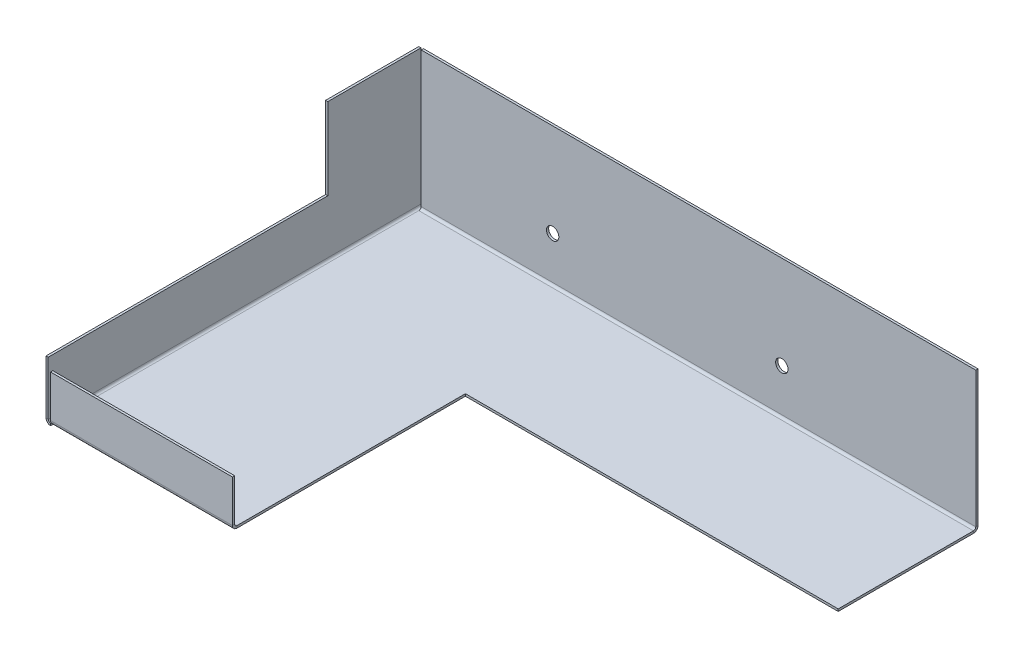
ISO-10303-21;
HEADER;
FILE_DESCRIPTION(('STEP AP214'),'2;1');
FILE_NAME('part.step','',(''),(''),'','','');
FILE_SCHEMA(('AUTOMOTIVE_DESIGN { 1 0 10303 214 1 1 1 1 }'));
ENDSEC;
DATA;
#1=APPLICATION_CONTEXT('core data for automotive mechanical design processes');
#2=APPLICATION_PROTOCOL_DEFINITION('international standard','automotive_design',2000,#1);
#3=PRODUCT_CONTEXT('',#1,'mechanical');
#4=PRODUCT('Part','Part','',(#3));
#5=PRODUCT_RELATED_PRODUCT_CATEGORY('part','',(#4));
#6=PRODUCT_DEFINITION_FORMATION('','',#4);
#7=PRODUCT_DEFINITION_CONTEXT('part definition',#1,'design');
#8=PRODUCT_DEFINITION('design','',#6,#7);
#9=PRODUCT_DEFINITION_SHAPE('','',#8);
#10=(LENGTH_UNIT() NAMED_UNIT(*) SI_UNIT(.MILLI.,.METRE.));
#11=(NAMED_UNIT(*) PLANE_ANGLE_UNIT() SI_UNIT($,.RADIAN.));
#12=(NAMED_UNIT(*) SI_UNIT($,.STERADIAN.) SOLID_ANGLE_UNIT());
#13=UNCERTAINTY_MEASURE_WITH_UNIT(LENGTH_MEASURE(1.E-05),#10,'distance_accuracy_value','');
#14=(GEOMETRIC_REPRESENTATION_CONTEXT(3) GLOBAL_UNCERTAINTY_ASSIGNED_CONTEXT((#13)) GLOBAL_UNIT_ASSIGNED_CONTEXT((#10,
#11,#12)) REPRESENTATION_CONTEXT('',''));
#15=CARTESIAN_POINT('',(0.,0.,0.));
#16=DIRECTION('',(0.,0.,1.));
#17=DIRECTION('',(1.,0.,0.));
#18=AXIS2_PLACEMENT_3D('',#15,#16,#17);
#19=CARTESIAN_POINT('',(2.4892,0.,-2.4892));
#20=DIRECTION('',(1.,0.,0.));
#21=DIRECTION('',(0.,0.,-1.));
#22=AXIS2_PLACEMENT_3D('',#19,#20,#21);
#23=PLANE('',#22);
#24=DIRECTION('',(0.,0.,1.));
#25=VECTOR('',#24,1.);
#26=CARTESIAN_POINT('',(2.4892,-1.2192,0.));
#27=LINE('',#26,#25);
#28=CARTESIAN_POINT('',(2.4892,-1.2192,0.));
#29=VERTEX_POINT('',#28);
#30=CARTESIAN_POINT('',(2.4892,-1.2192,-2.4892));
#31=VERTEX_POINT('',#30);
#32=EDGE_CURVE('E432',#29,#31,#27,.F.);
#33=ORIENTED_EDGE('',*,*,#32,.T.);
#34=CARTESIAN_POINT('',(2.4892,1.27,-2.4892));
#35=DIRECTION('',(1.,0.,0.));
#36=DIRECTION('',(0.,0.,-1.));
#37=AXIS2_PLACEMENT_3D('',#34,#35,#36);
#38=CIRCLE('',#37,2.4892);
#39=CARTESIAN_POINT('',(2.4892,0.,-0.348355157420321));
#40=VERTEX_POINT('',#39);
#41=EDGE_CURVE('E305',#31,#40,#38,.F.);
#42=ORIENTED_EDGE('',*,*,#41,.T.);
#43=DIRECTION('',(0.,0.,1.));
#44=VECTOR('',#43,1.);
#45=CARTESIAN_POINT('',(2.4892,0.,0.));
#46=LINE('',#45,#44);
#47=CARTESIAN_POINT('',(2.4892,0.,0.));
#48=VERTEX_POINT('',#47);
#49=EDGE_CURVE('E446',#48,#40,#46,.F.);
#50=ORIENTED_EDGE('',*,*,#49,.F.);
#51=DIRECTION('',(0.,-1.,0.));
#52=VECTOR('',#51,1.);
#53=CARTESIAN_POINT('',(2.4892,0.,0.));
#54=LINE('',#53,#52);
#55=EDGE_CURVE('E439',#48,#29,#54,.T.);
#56=ORIENTED_EDGE('',*,*,#55,.T.);
#57=EDGE_LOOP('',(#33,#42,#50,#56));
#58=FACE_BOUND('',#57,.T.);
#59=ADVANCED_FACE('F100',(#58),#23,.T.);
#60=CARTESIAN_POINT('',(0.,-1.2192,0.));
#61=DIRECTION('',(0.,1.,0.));
#62=DIRECTION('',(0.,0.,1.));
#63=AXIS2_PLACEMENT_3D('',#60,#61,#62);
#64=PLANE('',#63);
#65=DIRECTION('',(1.,0.,0.));
#66=VECTOR('',#65,1.);
#67=CARTESIAN_POINT('',(101.6,-1.2192,-2.4892));
#68=LINE('',#67,#66);
#69=CARTESIAN_POINT('',(101.6,-1.2192,-2.4892));
#70=VERTEX_POINT('',#69);
#71=EDGE_CURVE('E300',#70,#31,#68,.F.);
#72=ORIENTED_EDGE('',*,*,#71,.T.);
#73=CARTESIAN_POINT('',(2.48920000000002,-1.2192,-200.7108));
#74=VERTEX_POINT('',#73);
#75=EDGE_CURVE('E436',#31,#74,#27,.F.);
#76=ORIENTED_EDGE('',*,*,#75,.T.);
#77=DIRECTION('',(-1.,0.,0.));
#78=VECTOR('',#77,1.);
#79=CARTESIAN_POINT('',(2.48919999999997,-1.21920000000001,-200.7108));
#80=LINE('',#79,#78);
#81=CARTESIAN_POINT('',(304.8,-1.2192,-200.7108));
#82=VERTEX_POINT('',#81);
#83=EDGE_CURVE('E378',#74,#82,#80,.F.);
#84=ORIENTED_EDGE('',*,*,#83,.T.);
#85=DIRECTION('',(0.,0.,-1.));
#86=VECTOR('',#85,1.);
#87=CARTESIAN_POINT('',(304.8,-1.2192,-127.));
#88=LINE('',#87,#86);
#89=CARTESIAN_POINT('',(304.8,-1.2192,-127.));
#90=VERTEX_POINT('',#89);
#91=EDGE_CURVE('E464',#90,#82,#88,.T.);
#92=ORIENTED_EDGE('',*,*,#91,.F.);
#93=DIRECTION('',(1.,0.,0.));
#94=VECTOR('',#93,1.);
#95=CARTESIAN_POINT('',(101.6,-1.2192,-127.));
#96=LINE('',#95,#94);
#97=CARTESIAN_POINT('',(101.6,-1.2192,-127.));
#98=VERTEX_POINT('',#97);
#99=EDGE_CURVE('E460',#98,#90,#96,.T.);
#100=ORIENTED_EDGE('',*,*,#99,.F.);
#101=DIRECTION('',(0.,0.,-1.));
#102=VECTOR('',#101,1.);
#103=CARTESIAN_POINT('',(101.6,-1.2192,0.));
#104=LINE('',#103,#102);
#105=EDGE_CURVE('E458',#70,#98,#104,.T.);
#106=ORIENTED_EDGE('',*,*,#105,.F.);
#107=EDGE_LOOP('',(#72,#76,#84,#92,#100,#106));
#108=FACE_BOUND('',#107,.T.);
#109=ADVANCED_FACE('F504',(#108),#64,.F.);
#110=CARTESIAN_POINT('',(0.,0.,0.));
#111=DIRECTION('',(0.,1.,0.));
#112=DIRECTION('',(0.,0.,1.));
#113=AXIS2_PLACEMENT_3D('',#110,#111,#112);
#114=PLANE('',#113);
#115=CARTESIAN_POINT('',(2.4892,0.,-2.4892));
#116=VERTEX_POINT('',#115);
#117=CARTESIAN_POINT('',(2.48920000000002,0.,-200.7108));
#118=VERTEX_POINT('',#117);
#119=EDGE_CURVE('E450',#116,#118,#46,.F.);
#120=ORIENTED_EDGE('',*,*,#119,.F.);
#121=DIRECTION('',(1.,0.,0.));
#122=VECTOR('',#121,1.);
#123=CARTESIAN_POINT('',(101.6,0.,-2.4892));
#124=LINE('',#123,#122);
#125=CARTESIAN_POINT('',(101.6,0.,-2.4892));
#126=VERTEX_POINT('',#125);
#127=EDGE_CURVE('E312',#126,#116,#124,.F.);
#128=ORIENTED_EDGE('',*,*,#127,.F.);
#129=DIRECTION('',(0.,0.,-1.));
#130=VECTOR('',#129,1.);
#131=CARTESIAN_POINT('',(101.6,0.,0.));
#132=LINE('',#131,#130);
#133=CARTESIAN_POINT('',(101.6,0.,-127.));
#134=VERTEX_POINT('',#133);
#135=EDGE_CURVE('E456',#126,#134,#132,.T.);
#136=ORIENTED_EDGE('',*,*,#135,.T.);
#137=DIRECTION('',(1.,0.,0.));
#138=VECTOR('',#137,1.);
#139=CARTESIAN_POINT('',(101.6,0.,-127.));
#140=LINE('',#139,#138);
#141=CARTESIAN_POINT('',(304.8,0.,-127.));
#142=VERTEX_POINT('',#141);
#143=EDGE_CURVE('E468',#134,#142,#140,.T.);
#144=ORIENTED_EDGE('',*,*,#143,.T.);
#145=DIRECTION('',(0.,0.,-1.));
#146=VECTOR('',#145,1.);
#147=CARTESIAN_POINT('',(304.8,0.,-127.));
#148=LINE('',#147,#146);
#149=CARTESIAN_POINT('',(304.8,0.,-200.7108));
#150=VERTEX_POINT('',#149);
#151=EDGE_CURVE('E461',#142,#150,#148,.T.);
#152=ORIENTED_EDGE('',*,*,#151,.T.);
#153=DIRECTION('',(-1.,0.,0.));
#154=VECTOR('',#153,1.);
#155=CARTESIAN_POINT('',(2.48919999999997,0.,-200.7108));
#156=LINE('',#155,#154);
#157=EDGE_CURVE('E388',#118,#150,#156,.F.);
#158=ORIENTED_EDGE('',*,*,#157,.F.);
#159=EDGE_LOOP('',(#120,#128,#136,#144,#152,#158));
#160=FACE_BOUND('',#159,.T.);
#161=ADVANCED_FACE('F484',(#160),#114,.T.);
#162=CARTESIAN_POINT('',(101.6,-1.2192,0.));
#163=DIRECTION('',(1.,0.,0.));
#164=DIRECTION('',(0.,0.,-1.));
#165=AXIS2_PLACEMENT_3D('',#162,#163,#164);
#166=PLANE('',#165);
#167=ORIENTED_EDGE('',*,*,#135,.F.);
#168=DIRECTION('',(0.,-1.,0.));
#169=VECTOR('',#168,1.);
#170=CARTESIAN_POINT('',(101.6,0.,-2.4892));
#171=LINE('',#170,#169);
#172=EDGE_CURVE('E308',#126,#70,#171,.T.);
#173=ORIENTED_EDGE('',*,*,#172,.T.);
#174=ORIENTED_EDGE('',*,*,#105,.T.);
#175=DIRECTION('',(0.,1.,0.));
#176=VECTOR('',#175,1.);
#177=CARTESIAN_POINT('',(101.6,-1.2192,-127.));
#178=LINE('',#177,#176);
#179=EDGE_CURVE('E104',#98,#134,#178,.T.);
#180=ORIENTED_EDGE('',*,*,#179,.T.);
#181=EDGE_LOOP('',(#167,#173,#174,#180));
#182=FACE_BOUND('',#181,.T.);
#183=ADVANCED_FACE('F102',(#182),#166,.T.);
#184=CARTESIAN_POINT('',(2.4892,0.,-203.2));
#185=DIRECTION('',(1.,0.,0.));
#186=DIRECTION('',(0.,0.,-1.));
#187=AXIS2_PLACEMENT_3D('',#184,#185,#186);
#188=PLANE('',#187);
#189=DIRECTION('',(0.,0.,1.));
#190=VECTOR('',#189,1.);
#191=CARTESIAN_POINT('',(2.4892,0.,-203.2));
#192=LINE('',#191,#190);
#193=CARTESIAN_POINT('',(2.4892,0.,-203.2));
#194=VERTEX_POINT('',#193);
#195=CARTESIAN_POINT('',(2.4892,0.,-202.85164484258));
#196=VERTEX_POINT('',#195);
#197=EDGE_CURVE('E396',#194,#196,#192,.T.);
#198=ORIENTED_EDGE('',*,*,#197,.T.);
#199=CARTESIAN_POINT('',(2.48920000000002,1.26999999999998,-200.7108));
#200=DIRECTION('',(-1.,0.,0.));
#201=DIRECTION('',(0.,0.,1.));
#202=AXIS2_PLACEMENT_3D('',#199,#200,#201);
#203=CIRCLE('',#202,2.48919999999999);
#204=EDGE_CURVE('E13',#196,#74,#203,.T.);
#205=ORIENTED_EDGE('',*,*,#204,.T.);
#206=DIRECTION('',(0.,0.,1.));
#207=VECTOR('',#206,1.);
#208=CARTESIAN_POINT('',(2.48920000000177,-1.2192,0.));
#209=LINE('',#208,#207);
#210=CARTESIAN_POINT('',(2.4892,-1.2192,-203.2));
#211=VERTEX_POINT('',#210);
#212=EDGE_CURVE('E399',#211,#74,#209,.T.);
#213=ORIENTED_EDGE('',*,*,#212,.F.);
#214=DIRECTION('',(0.,-1.,0.));
#215=VECTOR('',#214,1.);
#216=CARTESIAN_POINT('',(2.4892,0.,-203.2));
#217=LINE('',#216,#215);
#218=EDGE_CURVE('E453',#194,#211,#217,.T.);
#219=ORIENTED_EDGE('',*,*,#218,.F.);
#220=EDGE_LOOP('',(#198,#205,#213,#219));
#221=FACE_BOUND('',#220,.T.);
#222=ADVANCED_FACE('F604',(#221),#188,.T.);
#223=CARTESIAN_POINT('',(304.8,-1.2192,-127.));
#224=DIRECTION('',(1.,0.,0.));
#225=DIRECTION('',(0.,0.,-1.));
#226=AXIS2_PLACEMENT_3D('',#223,#224,#225);
#227=PLANE('',#226);
#228=DIRECTION('',(0.,-1.,0.));
#229=VECTOR('',#228,1.);
#230=CARTESIAN_POINT('',(304.8,0.,-200.7108));
#231=LINE('',#230,#229);
#232=EDGE_CURVE('E382',#150,#82,#231,.T.);
#233=ORIENTED_EDGE('',*,*,#232,.F.);
#234=ORIENTED_EDGE('',*,*,#151,.F.);
#235=DIRECTION('',(0.,1.,0.));
#236=VECTOR('',#235,1.);
#237=CARTESIAN_POINT('',(304.8,-1.2192,-127.));
#238=LINE('',#237,#236);
#239=EDGE_CURVE('E109',#90,#142,#238,.T.);
#240=ORIENTED_EDGE('',*,*,#239,.F.);
#241=ORIENTED_EDGE('',*,*,#91,.T.);
#242=EDGE_LOOP('',(#233,#234,#240,#241));
#243=FACE_BOUND('',#242,.T.);
#244=ADVANCED_FACE('F515',(#243),#227,.T.);
#245=CARTESIAN_POINT('',(101.6,-1.2192,-127.));
#246=DIRECTION('',(0.,0.,1.));
#247=DIRECTION('',(1.,0.,0.));
#248=AXIS2_PLACEMENT_3D('',#245,#246,#247);
#249=PLANE('',#248);
#250=ORIENTED_EDGE('',*,*,#143,.F.);
#251=ORIENTED_EDGE('',*,*,#179,.F.);
#252=ORIENTED_EDGE('',*,*,#99,.T.);
#253=ORIENTED_EDGE('',*,*,#239,.T.);
#254=EDGE_LOOP('',(#250,#251,#252,#253));
#255=FACE_BOUND('',#254,.T.);
#256=ADVANCED_FACE('F481',(#255),#249,.T.);
#257=CARTESIAN_POINT('',(2.4892,1.27,-203.2));
#258=DIRECTION('',(0.,0.,-1.));
#259=DIRECTION('',(-1.,0.,0.));
#260=AXIS2_PLACEMENT_3D('',#257,#258,#259);
#261=PLANE('',#260);
#262=DIRECTION('',(1.,0.,0.));
#263=VECTOR('',#262,1.);
#264=CARTESIAN_POINT('',(0.,1.26999999999999,-203.2));
#265=LINE('',#264,#263);
#266=CARTESIAN_POINT('',(1.2192,1.27,-203.2));
#267=VERTEX_POINT('',#266);
#268=CARTESIAN_POINT('',(0.,1.26999999999999,-203.2));
#269=VERTEX_POINT('',#268);
#270=EDGE_CURVE('E402',#267,#269,#265,.F.);
#271=ORIENTED_EDGE('',*,*,#270,.F.);
#272=CARTESIAN_POINT('',(2.4892,1.27,-203.2));
#273=DIRECTION('',(0.,0.,1.));
#274=DIRECTION('',(1.,0.,0.));
#275=AXIS2_PLACEMENT_3D('',#272,#273,#274);
#276=CIRCLE('',#275,1.27);
#277=EDGE_CURVE('E443',#194,#267,#276,.F.);
#278=ORIENTED_EDGE('',*,*,#277,.F.);
#279=ORIENTED_EDGE('',*,*,#218,.T.);
#280=CARTESIAN_POINT('',(2.4892,1.27,-203.2));
#281=DIRECTION('',(0.,0.,1.));
#282=DIRECTION('',(1.,0.,0.));
#283=AXIS2_PLACEMENT_3D('',#280,#281,#282);
#284=CIRCLE('',#283,2.4892);
#285=EDGE_CURVE('E435',#211,#269,#284,.F.);
#286=ORIENTED_EDGE('',*,*,#285,.T.);
#287=EDGE_LOOP('',(#271,#278,#279,#286));
#288=FACE_BOUND('',#287,.T.);
#289=ADVANCED_FACE('F631',(#288),#261,.T.);
#290=CARTESIAN_POINT('',(2.4892,1.27,0.));
#291=DIRECTION('',(0.,0.,-1.));
#292=DIRECTION('',(-1.,0.,0.));
#293=AXIS2_PLACEMENT_3D('',#290,#291,#292);
#294=PLANE('',#293);
#295=CARTESIAN_POINT('',(2.4892,1.27,0.));
#296=DIRECTION('',(0.,0.,1.));
#297=DIRECTION('',(1.,0.,0.));
#298=AXIS2_PLACEMENT_3D('',#295,#296,#297);
#299=CIRCLE('',#298,1.27);
#300=CARTESIAN_POINT('',(1.2192,1.27,0.));
#301=VERTEX_POINT('',#300);
#302=EDGE_CURVE('E406',#301,#48,#299,.T.);
#303=ORIENTED_EDGE('',*,*,#302,.F.);
#304=DIRECTION('',(1.,0.,0.));
#305=VECTOR('',#304,1.);
#306=CARTESIAN_POINT('',(1.2192,1.27,0.));
#307=LINE('',#306,#305);
#308=CARTESIAN_POINT('',(0.,1.26999999999999,0.));
#309=VERTEX_POINT('',#308);
#310=EDGE_CURVE('E425',#301,#309,#307,.F.);
#311=ORIENTED_EDGE('',*,*,#310,.T.);
#312=CARTESIAN_POINT('',(2.4892,1.27,0.));
#313=DIRECTION('',(0.,0.,1.));
#314=DIRECTION('',(1.,0.,0.));
#315=AXIS2_PLACEMENT_3D('',#312,#313,#314);
#316=CIRCLE('',#315,2.4892);
#317=EDGE_CURVE('E440',#309,#29,#316,.T.);
#318=ORIENTED_EDGE('',*,*,#317,.T.);
#319=ORIENTED_EDGE('',*,*,#55,.F.);
#320=EDGE_LOOP('',(#303,#311,#318,#319));
#321=FACE_BOUND('',#320,.T.);
#322=ADVANCED_FACE('F628',(#321),#294,.F.);
#323=CARTESIAN_POINT('',(2.4892,1.27,0.));
#324=DIRECTION('',(0.,0.,1.));
#325=DIRECTION('',(-1.,0.,0.));
#326=AXIS2_PLACEMENT_3D('',#323,#324,#325);
#327=CYLINDRICAL_SURFACE('',#326,2.4892);
#328=ORIENTED_EDGE('',*,*,#32,.F.);
#329=ORIENTED_EDGE('',*,*,#317,.F.);
#330=DIRECTION('',(0.,0.,1.));
#331=VECTOR('',#330,1.);
#332=CARTESIAN_POINT('',(0.,1.26999999999999,-203.2));
#333=LINE('',#332,#331);
#334=EDGE_CURVE('E423',#309,#269,#333,.F.);
#335=ORIENTED_EDGE('',*,*,#334,.T.);
#336=ORIENTED_EDGE('',*,*,#285,.F.);
#337=ORIENTED_EDGE('',*,*,#212,.T.);
#338=ORIENTED_EDGE('',*,*,#75,.F.);
#339=EDGE_LOOP('',(#328,#329,#335,#336,#337,#338));
#340=FACE_BOUND('',#339,.T.);
#341=ADVANCED_FACE('F505',(#340),#327,.T.);
#342=CARTESIAN_POINT('',(2.4892,1.27,0.));
#343=DIRECTION('',(0.,0.,1.));
#344=DIRECTION('',(-1.,0.,0.));
#345=AXIS2_PLACEMENT_3D('',#342,#343,#344);
#346=CYLINDRICAL_SURFACE('',#345,1.27);
#347=ORIENTED_EDGE('',*,*,#49,.T.);
#348=EDGE_CURVE('E449',#40,#116,#46,.F.);
#349=ORIENTED_EDGE('',*,*,#348,.T.);
#350=ORIENTED_EDGE('',*,*,#119,.T.);
#351=EDGE_CURVE('E395',#196,#118,#192,.T.);
#352=ORIENTED_EDGE('',*,*,#351,.F.);
#353=ORIENTED_EDGE('',*,*,#197,.F.);
#354=ORIENTED_EDGE('',*,*,#277,.T.);
#355=DIRECTION('',(0.,0.,1.));
#356=VECTOR('',#355,1.);
#357=CARTESIAN_POINT('',(1.2192,1.27,-203.2));
#358=LINE('',#357,#356);
#359=EDGE_CURVE('E428',#267,#301,#358,.T.);
#360=ORIENTED_EDGE('',*,*,#359,.T.);
#361=ORIENTED_EDGE('',*,*,#302,.T.);
#362=EDGE_LOOP('',(#347,#349,#350,#352,#353,#354,#360,#361));
#363=FACE_BOUND('',#362,.T.);
#364=ADVANCED_FACE('F493',(#363),#346,.F.);
#365=CARTESIAN_POINT('',(-2.61726404438001E-13,74.9808,0.));
#366=DIRECTION('',(0.,0.,-1.));
#367=DIRECTION('',(-1.,0.,0.));
#368=AXIS2_PLACEMENT_3D('',#365,#366,#367);
#369=PLANE('',#368);
#370=DIRECTION('',(0.,-1.,0.));
#371=VECTOR('',#370,1.);
#372=CARTESIAN_POINT('',(1.21919999999974,74.9808,0.));
#373=LINE('',#372,#371);
#374=CARTESIAN_POINT('',(1.21919999999989,30.5308,0.));
#375=VERTEX_POINT('',#374);
#376=EDGE_CURVE('E420',#301,#375,#373,.F.);
#377=ORIENTED_EDGE('',*,*,#376,.T.);
#378=DIRECTION('',(1.,0.,0.));
#379=VECTOR('',#378,1.);
#380=CARTESIAN_POINT('',(-3.72748706900516E-13,30.5308,0.));
#381=LINE('',#380,#379);
#382=CARTESIAN_POINT('',(-3.72748706900516E-13,30.5308,0.));
#383=VERTEX_POINT('',#382);
#384=EDGE_CURVE('E332',#383,#375,#381,.T.);
#385=ORIENTED_EDGE('',*,*,#384,.F.);
#386=DIRECTION('',(0.,1.,0.));
#387=VECTOR('',#386,1.);
#388=CARTESIAN_POINT('',(0.,0.,0.));
#389=LINE('',#388,#387);
#390=EDGE_CURVE('E412',#309,#383,#389,.T.);
#391=ORIENTED_EDGE('',*,*,#390,.F.);
#392=ORIENTED_EDGE('',*,*,#310,.F.);
#393=EDGE_LOOP('',(#377,#385,#391,#392));
#394=FACE_BOUND('',#393,.T.);
#395=ADVANCED_FACE('F618',(#394),#369,.F.);
#396=CARTESIAN_POINT('',(0.,0.,-203.2));
#397=DIRECTION('',(0.,0.,1.));
#398=DIRECTION('',(1.,0.,0.));
#399=AXIS2_PLACEMENT_3D('',#396,#397,#398);
#400=PLANE('',#399);
#401=ORIENTED_EDGE('',*,*,#270,.T.);
#402=DIRECTION('',(0.,-1.,0.));
#403=VECTOR('',#402,1.);
#404=CARTESIAN_POINT('',(0.,0.,-203.2));
#405=LINE('',#404,#403);
#406=CARTESIAN_POINT('',(-2.61794063971529E-13,74.9808,-203.2));
#407=VERTEX_POINT('',#406);
#408=EDGE_CURVE('E407',#407,#269,#405,.T.);
#409=ORIENTED_EDGE('',*,*,#408,.F.);
#410=DIRECTION('',(1.,0.,0.));
#411=VECTOR('',#410,1.);
#412=CARTESIAN_POINT('',(-2.61794063971529E-13,74.9808,-203.2));
#413=LINE('',#412,#411);
#414=CARTESIAN_POINT('',(1.21919999999974,74.9808,-203.2));
#415=VERTEX_POINT('',#414);
#416=EDGE_CURVE('E403',#407,#415,#413,.T.);
#417=ORIENTED_EDGE('',*,*,#416,.T.);
#418=DIRECTION('',(0.,1.,0.));
#419=VECTOR('',#418,1.);
#420=CARTESIAN_POINT('',(1.2192,0.,-203.2));
#421=LINE('',#420,#419);
#422=EDGE_CURVE('E415',#415,#267,#421,.F.);
#423=ORIENTED_EDGE('',*,*,#422,.T.);
#424=EDGE_LOOP('',(#401,#409,#417,#423));
#425=FACE_BOUND('',#424,.T.);
#426=ADVANCED_FACE('F611',(#425),#400,.F.);
#427=CARTESIAN_POINT('',(0.,0.,0.));
#428=DIRECTION('',(1.,0.,0.));
#429=DIRECTION('',(0.,1.,0.));
#430=AXIS2_PLACEMENT_3D('',#427,#428,#429);
#431=PLANE('',#430);
#432=DIRECTION('',(0.,0.,-1.));
#433=VECTOR('',#432,1.);
#434=CARTESIAN_POINT('',(-3.72748706900516E-13,30.5308,0.));
#435=LINE('',#434,#433);
#436=CARTESIAN_POINT('',(-3.72748706900516E-13,30.5308,-152.4));
#437=VERTEX_POINT('',#436);
#438=EDGE_CURVE('E326',#383,#437,#435,.T.);
#439=ORIENTED_EDGE('',*,*,#438,.T.);
#440=DIRECTION('',(0.,1.,0.));
#441=VECTOR('',#440,1.);
#442=CARTESIAN_POINT('',(-5.27789617565944E-13,74.9808,-152.4));
#443=LINE('',#442,#441);
#444=CARTESIAN_POINT('',(-5.27789617565944E-13,74.9808,-152.4));
#445=VERTEX_POINT('',#444);
#446=EDGE_CURVE('E329',#437,#445,#443,.T.);
#447=ORIENTED_EDGE('',*,*,#446,.T.);
#448=DIRECTION('',(0.,0.,-1.));
#449=VECTOR('',#448,1.);
#450=CARTESIAN_POINT('',(-2.61794063971529E-13,74.9808,0.));
#451=LINE('',#450,#449);
#452=EDGE_CURVE('E410',#445,#407,#451,.T.);
#453=ORIENTED_EDGE('',*,*,#452,.T.);
#454=ORIENTED_EDGE('',*,*,#408,.T.);
#455=ORIENTED_EDGE('',*,*,#334,.F.);
#456=ORIENTED_EDGE('',*,*,#390,.T.);
#457=EDGE_LOOP('',(#439,#447,#453,#454,#455,#456));
#458=FACE_BOUND('',#457,.T.);
#459=ADVANCED_FACE('F607',(#458),#431,.F.);
#460=CARTESIAN_POINT('',(1.2192,0.,0.));
#461=DIRECTION('',(1.,0.,0.));
#462=DIRECTION('',(0.,1.,0.));
#463=AXIS2_PLACEMENT_3D('',#460,#461,#462);
#464=PLANE('',#463);
#465=DIRECTION('',(0.,1.,0.));
#466=VECTOR('',#465,1.);
#467=CARTESIAN_POINT('',(1.21919999999974,74.9808,-152.4));
#468=LINE('',#467,#466);
#469=CARTESIAN_POINT('',(1.21919999999989,30.5308,-152.4));
#470=VERTEX_POINT('',#469);
#471=CARTESIAN_POINT('',(1.21919999999974,74.9808,-152.4));
#472=VERTEX_POINT('',#471);
#473=EDGE_CURVE('E126',#470,#472,#468,.T.);
#474=ORIENTED_EDGE('',*,*,#473,.F.);
#475=DIRECTION('',(0.,0.,-1.));
#476=VECTOR('',#475,1.);
#477=CARTESIAN_POINT('',(1.21919999999989,30.5308,0.));
#478=LINE('',#477,#476);
#479=EDGE_CURVE('E325',#375,#470,#478,.T.);
#480=ORIENTED_EDGE('',*,*,#479,.F.);
#481=ORIENTED_EDGE('',*,*,#376,.F.);
#482=ORIENTED_EDGE('',*,*,#359,.F.);
#483=ORIENTED_EDGE('',*,*,#422,.F.);
#484=DIRECTION('',(0.,0.,1.));
#485=VECTOR('',#484,1.);
#486=CARTESIAN_POINT('',(1.21919999999974,74.9808,-203.2));
#487=LINE('',#486,#485);
#488=EDGE_CURVE('E418',#472,#415,#487,.F.);
#489=ORIENTED_EDGE('',*,*,#488,.F.);
#490=EDGE_LOOP('',(#474,#480,#481,#482,#483,#489));
#491=FACE_BOUND('',#490,.T.);
#492=ADVANCED_FACE('F610',(#491),#464,.T.);
#493=CARTESIAN_POINT('',(-2.61726404438001E-13,74.9808,-203.2));
#494=DIRECTION('',(0.,-1.,0.));
#495=DIRECTION('',(1.,0.,0.));
#496=AXIS2_PLACEMENT_3D('',#493,#494,#495);
#497=PLANE('',#496);
#498=ORIENTED_EDGE('',*,*,#452,.F.);
#499=DIRECTION('',(1.,0.,0.));
#500=VECTOR('',#499,1.);
#501=CARTESIAN_POINT('',(-5.27789617565944E-13,74.9808,-152.4));
#502=LINE('',#501,#500);
#503=EDGE_CURVE('E336',#445,#472,#502,.T.);
#504=ORIENTED_EDGE('',*,*,#503,.T.);
#505=ORIENTED_EDGE('',*,*,#488,.T.);
#506=ORIENTED_EDGE('',*,*,#416,.F.);
#507=EDGE_LOOP('',(#498,#504,#505,#506));
#508=FACE_BOUND('',#507,.T.);
#509=ADVANCED_FACE('F601',(#508),#497,.F.);
#510=CARTESIAN_POINT('',(304.8,1.26999999999998,-200.7108));
#511=DIRECTION('',(1.,0.,0.));
#512=DIRECTION('',(0.,0.,-1.));
#513=AXIS2_PLACEMENT_3D('',#510,#511,#512);
#514=PLANE('',#513);
#515=DIRECTION('',(0.,0.,1.));
#516=VECTOR('',#515,1.);
#517=CARTESIAN_POINT('',(304.8,1.27,-203.2));
#518=LINE('',#517,#516);
#519=CARTESIAN_POINT('',(304.8,1.26999999999998,-201.9808));
#520=VERTEX_POINT('',#519);
#521=CARTESIAN_POINT('',(304.8,1.26999999999998,-203.2));
#522=VERTEX_POINT('',#521);
#523=EDGE_CURVE('E347',#520,#522,#518,.F.);
#524=ORIENTED_EDGE('',*,*,#523,.F.);
#525=CARTESIAN_POINT('',(304.8,1.26999999999998,-200.7108));
#526=DIRECTION('',(-1.,0.,0.));
#527=DIRECTION('',(0.,0.,1.));
#528=AXIS2_PLACEMENT_3D('',#525,#526,#527);
#529=CIRCLE('',#528,1.26999999999999);
#530=EDGE_CURVE('E385',#150,#520,#529,.F.);
#531=ORIENTED_EDGE('',*,*,#530,.F.);
#532=ORIENTED_EDGE('',*,*,#232,.T.);
#533=CARTESIAN_POINT('',(304.8,1.26999999999998,-200.7108));
#534=DIRECTION('',(-1.,0.,0.));
#535=DIRECTION('',(0.,0.,1.));
#536=AXIS2_PLACEMENT_3D('',#533,#534,#535);
#537=CIRCLE('',#536,2.48919999999999);
#538=EDGE_CURVE('E380',#82,#522,#537,.F.);
#539=ORIENTED_EDGE('',*,*,#538,.T.);
#540=EDGE_LOOP('',(#524,#531,#532,#539));
#541=FACE_BOUND('',#540,.T.);
#542=ADVANCED_FACE('F518',(#541),#514,.T.);
#543=CARTESIAN_POINT('',(2.48920000000002,1.26999999999998,-200.7108));
#544=DIRECTION('',(1.,0.,0.));
#545=DIRECTION('',(0.,0.,-1.));
#546=AXIS2_PLACEMENT_3D('',#543,#544,#545);
#547=PLANE('',#546);
#548=CARTESIAN_POINT('',(2.4892,1.27,-203.2));
#549=VERTEX_POINT('',#548);
#550=EDGE_CURVE('E111',#549,#196,#203,.T.);
#551=ORIENTED_EDGE('',*,*,#550,.T.);
#552=ORIENTED_EDGE('',*,*,#351,.T.);
#553=CARTESIAN_POINT('',(2.48920000000002,1.26999999999998,-200.7108));
#554=DIRECTION('',(-1.,0.,0.));
#555=DIRECTION('',(0.,0.,1.));
#556=AXIS2_PLACEMENT_3D('',#553,#554,#555);
#557=CIRCLE('',#556,1.26999999999999);
#558=CARTESIAN_POINT('',(2.48920000000002,1.26999999999998,-201.9808));
#559=VERTEX_POINT('',#558);
#560=EDGE_CURVE('E351',#559,#118,#557,.T.);
#561=ORIENTED_EDGE('',*,*,#560,.F.);
#562=DIRECTION('',(0.,0.,1.));
#563=VECTOR('',#562,1.);
#564=CARTESIAN_POINT('',(2.48920000000002,1.26999999999999,-201.9808));
#565=LINE('',#564,#563);
#566=EDGE_CURVE('E371',#559,#549,#565,.F.);
#567=ORIENTED_EDGE('',*,*,#566,.T.);
#568=EDGE_LOOP('',(#551,#552,#561,#567));
#569=FACE_BOUND('',#568,.T.);
#570=ADVANCED_FACE('F542',(#569),#547,.F.);
#571=CARTESIAN_POINT('',(2.48919999999997,1.26999999999998,-200.7108));
#572=DIRECTION('',(-1.,0.,0.));
#573=DIRECTION('',(0.,0.,-1.));
#574=AXIS2_PLACEMENT_3D('',#571,#572,#573);
#575=CYLINDRICAL_SURFACE('',#574,2.48919999999999);
#576=ORIENTED_EDGE('',*,*,#83,.F.);
#577=ORIENTED_EDGE('',*,*,#204,.F.);
#578=ORIENTED_EDGE('',*,*,#550,.F.);
#579=DIRECTION('',(-1.,0.,0.));
#580=VECTOR('',#579,1.);
#581=CARTESIAN_POINT('',(304.8,1.27,-203.2));
#582=LINE('',#581,#580);
#583=EDGE_CURVE('E369',#549,#522,#582,.F.);
#584=ORIENTED_EDGE('',*,*,#583,.T.);
#585=ORIENTED_EDGE('',*,*,#538,.F.);
#586=EDGE_LOOP('',(#576,#577,#578,#584,#585));
#587=FACE_BOUND('',#586,.T.);
#588=ADVANCED_FACE('F512',(#587),#575,.T.);
#589=CARTESIAN_POINT('',(2.48919999999997,1.26999999999998,-200.7108));
#590=DIRECTION('',(-1.,0.,0.));
#591=DIRECTION('',(0.,0.,-1.));
#592=AXIS2_PLACEMENT_3D('',#589,#590,#591);
#593=CYLINDRICAL_SURFACE('',#592,1.26999999999999);
#594=ORIENTED_EDGE('',*,*,#157,.T.);
#595=ORIENTED_EDGE('',*,*,#530,.T.);
#596=DIRECTION('',(-1.,0.,0.));
#597=VECTOR('',#596,1.);
#598=CARTESIAN_POINT('',(304.8,1.26999999999999,-201.9808));
#599=LINE('',#598,#597);
#600=EDGE_CURVE('E374',#520,#559,#599,.T.);
#601=ORIENTED_EDGE('',*,*,#600,.T.);
#602=ORIENTED_EDGE('',*,*,#560,.T.);
#603=EDGE_LOOP('',(#594,#595,#601,#602));
#604=FACE_BOUND('',#603,.T.);
#605=ADVANCED_FACE('F521',(#604),#593,.F.);
#606=CARTESIAN_POINT('',(304.8,0.,-203.2));
#607=DIRECTION('',(-1.,0.,0.));
#608=DIRECTION('',(0.,0.,1.));
#609=AXIS2_PLACEMENT_3D('',#606,#607,#608);
#610=PLANE('',#609);
#611=ORIENTED_EDGE('',*,*,#523,.T.);
#612=DIRECTION('',(0.,-1.,0.));
#613=VECTOR('',#612,1.);
#614=CARTESIAN_POINT('',(304.8,-6.78981173836761E-13,-203.2));
#615=LINE('',#614,#613);
#616=CARTESIAN_POINT('',(304.8,75.2298267425494,-203.2));
#617=VERTEX_POINT('',#616);
#618=EDGE_CURVE('E359',#617,#522,#615,.T.);
#619=ORIENTED_EDGE('',*,*,#618,.F.);
#620=DIRECTION('',(0.,0.,1.));
#621=VECTOR('',#620,1.);
#622=CARTESIAN_POINT('',(304.8,75.2298267425494,-203.2));
#623=LINE('',#622,#621);
#624=CARTESIAN_POINT('',(304.8,75.2298267425494,-201.9808));
#625=VERTEX_POINT('',#624);
#626=EDGE_CURVE('E352',#617,#625,#623,.T.);
#627=ORIENTED_EDGE('',*,*,#626,.T.);
#628=DIRECTION('',(0.,1.,0.));
#629=VECTOR('',#628,1.);
#630=CARTESIAN_POINT('',(304.8,0.,-201.9808));
#631=LINE('',#630,#629);
#632=EDGE_CURVE('E366',#625,#520,#631,.F.);
#633=ORIENTED_EDGE('',*,*,#632,.T.);
#634=EDGE_LOOP('',(#611,#619,#627,#633));
#635=FACE_BOUND('',#634,.T.);
#636=ADVANCED_FACE('F529',(#635),#610,.F.);
#637=CARTESIAN_POINT('',(2.4892,75.2298267425494,-203.2));
#638=DIRECTION('',(1.,0.,0.));
#639=DIRECTION('',(0.,1.,0.));
#640=AXIS2_PLACEMENT_3D('',#637,#638,#639);
#641=PLANE('',#640);
#642=ORIENTED_EDGE('',*,*,#566,.F.);
#643=DIRECTION('',(0.,-1.,0.));
#644=VECTOR('',#643,1.);
#645=CARTESIAN_POINT('',(2.4892,75.2298267425494,-201.9808));
#646=LINE('',#645,#644);
#647=CARTESIAN_POINT('',(2.48920000000002,75.2298267425494,-201.9808));
#648=VERTEX_POINT('',#647);
#649=EDGE_CURVE('E364',#559,#648,#646,.F.);
#650=ORIENTED_EDGE('',*,*,#649,.T.);
#651=DIRECTION('',(0.,0.,1.));
#652=VECTOR('',#651,1.);
#653=CARTESIAN_POINT('',(2.48920000000002,75.2298267425494,-203.2));
#654=LINE('',#653,#652);
#655=CARTESIAN_POINT('',(2.48920000000001,75.2298267425494,-203.2));
#656=VERTEX_POINT('',#655);
#657=EDGE_CURVE('E348',#656,#648,#654,.T.);
#658=ORIENTED_EDGE('',*,*,#657,.F.);
#659=DIRECTION('',(0.,1.,0.));
#660=VECTOR('',#659,1.);
#661=CARTESIAN_POINT('',(2.4892,-6.79282515575572E-13,-203.2));
#662=LINE('',#661,#660);
#663=EDGE_CURVE('E357',#549,#656,#662,.T.);
#664=ORIENTED_EDGE('',*,*,#663,.F.);
#665=EDGE_LOOP('',(#642,#650,#658,#664));
#666=FACE_BOUND('',#665,.T.);
#667=ADVANCED_FACE('F539',(#666),#641,.F.);
#668=CARTESIAN_POINT('',(0.,-6.78981173836761E-13,-203.2));
#669=DIRECTION('',(0.,0.,1.));
#670=DIRECTION('',(0.,-1.,0.));
#671=AXIS2_PLACEMENT_3D('',#668,#669,#670);
#672=PLANE('',#671);
#673=CARTESIAN_POINT('',(199.080372838812,24.4298267425494,-203.2));
#674=DIRECTION('',(0.,0.,-1.));
#675=DIRECTION('',(0.,1.,0.));
#676=AXIS2_PLACEMENT_3D('',#673,#674,#675);
#677=CIRCLE('',#676,3.37819999999997);
#678=CARTESIAN_POINT('',(199.080372838812,27.8080267425494,-203.2));
#679=VERTEX_POINT('',#678);
#680=EDGE_CURVE('E319',#679,#679,#677,.T.);
#681=ORIENTED_EDGE('',*,*,#680,.F.);
#682=EDGE_LOOP('',(#681));
#683=FACE_BOUND('',#682,.T.);
#684=CARTESIAN_POINT('',(74.1743016723355,24.4298267425494,-203.2));
#685=DIRECTION('',(0.,0.,-1.));
#686=DIRECTION('',(0.,1.,0.));
#687=AXIS2_PLACEMENT_3D('',#684,#685,#686);
#688=CIRCLE('',#687,3.37819999999997);
#689=CARTESIAN_POINT('',(74.1743016723355,27.8080267425494,-203.2));
#690=VERTEX_POINT('',#689);
#691=EDGE_CURVE('E338',#690,#690,#688,.T.);
#692=ORIENTED_EDGE('',*,*,#691,.F.);
#693=EDGE_LOOP('',(#692));
#694=FACE_BOUND('',#693,.T.);
#695=ORIENTED_EDGE('',*,*,#583,.F.);
#696=ORIENTED_EDGE('',*,*,#663,.T.);
#697=DIRECTION('',(1.,0.,0.));
#698=VECTOR('',#697,1.);
#699=CARTESIAN_POINT('',(0.,75.2298267425494,-203.2));
#700=LINE('',#699,#698);
#701=EDGE_CURVE('E355',#656,#617,#700,.T.);
#702=ORIENTED_EDGE('',*,*,#701,.T.);
#703=ORIENTED_EDGE('',*,*,#618,.T.);
#704=EDGE_LOOP('',(#695,#696,#702,#703));
#705=FACE_BOUND('',#704,.T.);
#706=ADVANCED_FACE('F545',(#683,#694,#705),#672,.F.);
#707=CARTESIAN_POINT('',(0.,-6.74724359788443E-13,-201.9808));
#708=DIRECTION('',(0.,0.,1.));
#709=DIRECTION('',(0.,-1.,0.));
#710=AXIS2_PLACEMENT_3D('',#707,#708,#709);
#711=PLANE('',#710);
#712=CARTESIAN_POINT('',(199.080372838812,24.4298267425494,-201.9808));
#713=DIRECTION('',(0.,0.,1.));
#714=DIRECTION('',(0.,-1.,0.));
#715=AXIS2_PLACEMENT_3D('',#712,#713,#714);
#716=CIRCLE('',#715,3.37819999999996);
#717=CARTESIAN_POINT('',(199.080372838812,21.0516267425495,-201.9808));
#718=VERTEX_POINT('',#717);
#719=EDGE_CURVE('E322',#718,#718,#716,.T.);
#720=ORIENTED_EDGE('',*,*,#719,.F.);
#721=EDGE_LOOP('',(#720));
#722=FACE_BOUND('',#721,.T.);
#723=CARTESIAN_POINT('',(74.1743016723355,24.4298267425494,-201.9808));
#724=DIRECTION('',(0.,0.,1.));
#725=DIRECTION('',(0.,-1.,0.));
#726=AXIS2_PLACEMENT_3D('',#723,#724,#725);
#727=CIRCLE('',#726,3.37819999999996);
#728=CARTESIAN_POINT('',(74.1743016723355,21.0516267425495,-201.9808));
#729=VERTEX_POINT('',#728);
#730=EDGE_CURVE('E344',#729,#729,#727,.T.);
#731=ORIENTED_EDGE('',*,*,#730,.F.);
#732=EDGE_LOOP('',(#731));
#733=FACE_BOUND('',#732,.T.);
#734=ORIENTED_EDGE('',*,*,#649,.F.);
#735=ORIENTED_EDGE('',*,*,#600,.F.);
#736=ORIENTED_EDGE('',*,*,#632,.F.);
#737=DIRECTION('',(-1.,0.,0.));
#738=VECTOR('',#737,1.);
#739=CARTESIAN_POINT('',(304.8,75.2298267425494,-201.9808));
#740=LINE('',#739,#738);
#741=EDGE_CURVE('E362',#648,#625,#740,.F.);
#742=ORIENTED_EDGE('',*,*,#741,.F.);
#743=EDGE_LOOP('',(#734,#735,#736,#742));
#744=FACE_BOUND('',#743,.T.);
#745=ADVANCED_FACE('F526',(#722,#733,#744),#711,.T.);
#746=CARTESIAN_POINT('',(304.8,75.2298267425494,-203.2));
#747=DIRECTION('',(0.,-1.,0.));
#748=DIRECTION('',(0.,0.,-1.));
#749=AXIS2_PLACEMENT_3D('',#746,#747,#748);
#750=PLANE('',#749);
#751=ORIENTED_EDGE('',*,*,#741,.T.);
#752=ORIENTED_EDGE('',*,*,#626,.F.);
#753=ORIENTED_EDGE('',*,*,#701,.F.);
#754=ORIENTED_EDGE('',*,*,#657,.T.);
#755=EDGE_LOOP('',(#751,#752,#753,#754));
#756=FACE_BOUND('',#755,.T.);
#757=ADVANCED_FACE('F534',(#756),#750,.F.);
#758=CARTESIAN_POINT('',(74.1743016723355,24.4298267425494,-203.2));
#759=DIRECTION('',(0.,0.,-1.));
#760=DIRECTION('',(0.,1.,0.));
#761=AXIS2_PLACEMENT_3D('',#758,#759,#760);
#762=CYLINDRICAL_SURFACE('',#761,3.37819999999996);
#763=ORIENTED_EDGE('',*,*,#730,.T.);
#764=EDGE_LOOP('',(#763));
#765=FACE_BOUND('',#764,.T.);
#766=ORIENTED_EDGE('',*,*,#691,.T.);
#767=EDGE_LOOP('',(#766));
#768=FACE_BOUND('',#767,.T.);
#769=ADVANCED_FACE('F577',(#765,#768),#762,.F.);
#770=CARTESIAN_POINT('',(-5.27789617565944E-13,74.9808,-152.4));
#771=DIRECTION('',(0.,0.,-1.));
#772=DIRECTION('',(-1.,0.,0.));
#773=AXIS2_PLACEMENT_3D('',#770,#771,#772);
#774=PLANE('',#773);
#775=ORIENTED_EDGE('',*,*,#473,.T.);
#776=ORIENTED_EDGE('',*,*,#503,.F.);
#777=ORIENTED_EDGE('',*,*,#446,.F.);
#778=DIRECTION('',(1.,0.,0.));
#779=VECTOR('',#778,1.);
#780=CARTESIAN_POINT('',(-3.72748706900516E-13,30.5308,-152.4));
#781=LINE('',#780,#779);
#782=EDGE_CURVE('E339',#437,#470,#781,.T.);
#783=ORIENTED_EDGE('',*,*,#782,.T.);
#784=EDGE_LOOP('',(#775,#776,#777,#783));
#785=FACE_BOUND('',#784,.T.);
#786=ADVANCED_FACE('F574',(#785),#774,.F.);
#787=CARTESIAN_POINT('',(-3.72748706900516E-13,30.5308,0.));
#788=DIRECTION('',(0.,-1.,0.));
#789=DIRECTION('',(1.,0.,0.));
#790=AXIS2_PLACEMENT_3D('',#787,#788,#789);
#791=PLANE('',#790);
#792=ORIENTED_EDGE('',*,*,#479,.T.);
#793=ORIENTED_EDGE('',*,*,#782,.F.);
#794=ORIENTED_EDGE('',*,*,#438,.F.);
#795=ORIENTED_EDGE('',*,*,#384,.T.);
#796=EDGE_LOOP('',(#792,#793,#794,#795));
#797=FACE_BOUND('',#796,.T.);
#798=ADVANCED_FACE('F572',(#797),#791,.F.);
#799=CARTESIAN_POINT('',(199.080372838812,24.4298267425494,-203.2));
#800=DIRECTION('',(0.,0.,-1.));
#801=DIRECTION('',(0.,1.,0.));
#802=AXIS2_PLACEMENT_3D('',#799,#800,#801);
#803=CYLINDRICAL_SURFACE('',#802,3.37819999999996);
#804=ORIENTED_EDGE('',*,*,#719,.T.);
#805=EDGE_LOOP('',(#804));
#806=FACE_BOUND('',#805,.T.);
#807=ORIENTED_EDGE('',*,*,#680,.T.);
#808=EDGE_LOOP('',(#807));
#809=FACE_BOUND('',#808,.T.);
#810=ADVANCED_FACE('F569',(#806,#809),#803,.F.);
#811=CARTESIAN_POINT('',(2.4892,1.27,-2.4892));
#812=DIRECTION('',(-1.,0.,0.));
#813=DIRECTION('',(0.,0.,1.));
#814=AXIS2_PLACEMENT_3D('',#811,#812,#813);
#815=PLANE('',#814);
#816=ORIENTED_EDGE('',*,*,#348,.F.);
#817=CARTESIAN_POINT('',(2.4892,1.27,0.));
#818=VERTEX_POINT('',#817);
#819=EDGE_CURVE('E303',#40,#818,#38,.F.);
#820=ORIENTED_EDGE('',*,*,#819,.T.);
#821=DIRECTION('',(0.,0.,-1.));
#822=VECTOR('',#821,1.);
#823=CARTESIAN_POINT('',(2.4892,1.27,0.));
#824=LINE('',#823,#822);
#825=CARTESIAN_POINT('',(2.4892,1.27,-1.2192));
#826=VERTEX_POINT('',#825);
#827=EDGE_CURVE('E282',#826,#818,#824,.F.);
#828=ORIENTED_EDGE('',*,*,#827,.F.);
#829=CARTESIAN_POINT('',(2.4892,1.27,-2.4892));
#830=DIRECTION('',(1.,0.,0.));
#831=DIRECTION('',(0.,0.,-1.));
#832=AXIS2_PLACEMENT_3D('',#829,#830,#831);
#833=CIRCLE('',#832,1.27);
#834=EDGE_CURVE('E118',#116,#826,#833,.F.);
#835=ORIENTED_EDGE('',*,*,#834,.F.);
#836=EDGE_LOOP('',(#816,#820,#828,#835));
#837=FACE_BOUND('',#836,.T.);
#838=ADVANCED_FACE('F495',(#837),#815,.T.);
#839=CARTESIAN_POINT('',(101.6,1.27,-2.4892));
#840=DIRECTION('',(-1.,0.,0.));
#841=DIRECTION('',(0.,0.,1.));
#842=AXIS2_PLACEMENT_3D('',#839,#840,#841);
#843=PLANE('',#842);
#844=CARTESIAN_POINT('',(101.6,1.27,-2.4892));
#845=DIRECTION('',(1.,0.,0.));
#846=DIRECTION('',(0.,0.,-1.));
#847=AXIS2_PLACEMENT_3D('',#844,#845,#846);
#848=CIRCLE('',#847,1.27);
#849=CARTESIAN_POINT('',(101.6,1.27,-1.2192));
#850=VERTEX_POINT('',#849);
#851=EDGE_CURVE('E314',#850,#126,#848,.T.);
#852=ORIENTED_EDGE('',*,*,#851,.F.);
#853=DIRECTION('',(0.,0.,-1.));
#854=VECTOR('',#853,1.);
#855=CARTESIAN_POINT('',(101.6,1.27,-1.2192));
#856=LINE('',#855,#854);
#857=CARTESIAN_POINT('',(101.6,1.27,0.));
#858=VERTEX_POINT('',#857);
#859=EDGE_CURVE('E294',#850,#858,#856,.F.);
#860=ORIENTED_EDGE('',*,*,#859,.T.);
#861=CARTESIAN_POINT('',(101.6,1.27,-2.4892));
#862=DIRECTION('',(1.,0.,0.));
#863=DIRECTION('',(0.,0.,-1.));
#864=AXIS2_PLACEMENT_3D('',#861,#862,#863);
#865=CIRCLE('',#864,2.4892);
#866=EDGE_CURVE('E304',#858,#70,#865,.T.);
#867=ORIENTED_EDGE('',*,*,#866,.T.);
#868=ORIENTED_EDGE('',*,*,#172,.F.);
#869=EDGE_LOOP('',(#852,#860,#867,#868));
#870=FACE_BOUND('',#869,.T.);
#871=ADVANCED_FACE('F567',(#870),#843,.F.);
#872=CARTESIAN_POINT('',(101.6,1.27,-2.4892));
#873=DIRECTION('',(1.,0.,0.));
#874=DIRECTION('',(0.,0.,1.));
#875=AXIS2_PLACEMENT_3D('',#872,#873,#874);
#876=CYLINDRICAL_SURFACE('',#875,2.4892);
#877=ORIENTED_EDGE('',*,*,#71,.F.);
#878=ORIENTED_EDGE('',*,*,#866,.F.);
#879=DIRECTION('',(1.,0.,0.));
#880=VECTOR('',#879,1.);
#881=CARTESIAN_POINT('',(2.4892,1.27,0.));
#882=LINE('',#881,#880);
#883=EDGE_CURVE('E291',#858,#818,#882,.F.);
#884=ORIENTED_EDGE('',*,*,#883,.T.);
#885=ORIENTED_EDGE('',*,*,#819,.F.);
#886=ORIENTED_EDGE('',*,*,#41,.F.);
#887=EDGE_LOOP('',(#877,#878,#884,#885,#886));
#888=FACE_BOUND('',#887,.T.);
#889=ADVANCED_FACE('F497',(#888),#876,.T.);
#890=CARTESIAN_POINT('',(101.6,1.27,-2.4892));
#891=DIRECTION('',(1.,0.,0.));
#892=DIRECTION('',(0.,0.,1.));
#893=AXIS2_PLACEMENT_3D('',#890,#891,#892);
#894=CYLINDRICAL_SURFACE('',#893,1.27);
#895=ORIENTED_EDGE('',*,*,#127,.T.);
#896=ORIENTED_EDGE('',*,*,#834,.T.);
#897=DIRECTION('',(1.,0.,0.));
#898=VECTOR('',#897,1.);
#899=CARTESIAN_POINT('',(2.4892,1.27,-1.2192));
#900=LINE('',#899,#898);
#901=EDGE_CURVE('E297',#826,#850,#900,.T.);
#902=ORIENTED_EDGE('',*,*,#901,.T.);
#903=ORIENTED_EDGE('',*,*,#851,.T.);
#904=EDGE_LOOP('',(#895,#896,#902,#903));
#905=FACE_BOUND('',#904,.T.);
#906=ADVANCED_FACE('F489',(#905),#894,.F.);
#907=CARTESIAN_POINT('',(2.4892,0.,0.));
#908=DIRECTION('',(1.,0.,0.));
#909=DIRECTION('',(0.,0.,-1.));
#910=AXIS2_PLACEMENT_3D('',#907,#908,#909);
#911=PLANE('',#910);
#912=ORIENTED_EDGE('',*,*,#827,.T.);
#913=DIRECTION('',(0.,-1.,0.));
#914=VECTOR('',#913,1.);
#915=CARTESIAN_POINT('',(2.4892,0.,0.));
#916=LINE('',#915,#914);
#917=CARTESIAN_POINT('',(2.4892,24.1808,0.));
#918=VERTEX_POINT('',#917);
#919=EDGE_CURVE('E263',#918,#818,#916,.T.);
#920=ORIENTED_EDGE('',*,*,#919,.F.);
#921=DIRECTION('',(0.,0.,-1.));
#922=VECTOR('',#921,1.);
#923=CARTESIAN_POINT('',(2.4892,24.1808,0.));
#924=LINE('',#923,#922);
#925=CARTESIAN_POINT('',(2.4892,24.1808,-1.2192));
#926=VERTEX_POINT('',#925);
#927=EDGE_CURVE('E269',#918,#926,#924,.T.);
#928=ORIENTED_EDGE('',*,*,#927,.T.);
#929=DIRECTION('',(0.,1.,0.));
#930=VECTOR('',#929,1.);
#931=CARTESIAN_POINT('',(2.4892,0.,-1.2192));
#932=LINE('',#931,#930);
#933=EDGE_CURVE('E289',#926,#826,#932,.F.);
#934=ORIENTED_EDGE('',*,*,#933,.T.);
#935=EDGE_LOOP('',(#912,#920,#928,#934));
#936=FACE_BOUND('',#935,.T.);
#937=ADVANCED_FACE('F281',(#936),#911,.F.);
#938=CARTESIAN_POINT('',(101.6,24.1808,0.));
#939=DIRECTION('',(-1.,0.,0.));
#940=DIRECTION('',(0.,0.,1.));
#941=AXIS2_PLACEMENT_3D('',#938,#939,#940);
#942=PLANE('',#941);
#943=ORIENTED_EDGE('',*,*,#859,.F.);
#944=DIRECTION('',(0.,-1.,0.));
#945=VECTOR('',#944,1.);
#946=CARTESIAN_POINT('',(101.6,24.1808,-1.2192));
#947=LINE('',#946,#945);
#948=CARTESIAN_POINT('',(101.6,24.1808,-1.2192));
#949=VERTEX_POINT('',#948);
#950=EDGE_CURVE('E285',#850,#949,#947,.F.);
#951=ORIENTED_EDGE('',*,*,#950,.T.);
#952=DIRECTION('',(0.,0.,-1.));
#953=VECTOR('',#952,1.);
#954=CARTESIAN_POINT('',(101.6,24.1808,0.));
#955=LINE('',#954,#953);
#956=CARTESIAN_POINT('',(101.6,24.1808,0.));
#957=VERTEX_POINT('',#956);
#958=EDGE_CURVE('E278',#957,#949,#955,.T.);
#959=ORIENTED_EDGE('',*,*,#958,.F.);
#960=DIRECTION('',(0.,1.,0.));
#961=VECTOR('',#960,1.);
#962=CARTESIAN_POINT('',(101.6,0.,0.));
#963=LINE('',#962,#961);
#964=EDGE_CURVE('E265',#858,#957,#963,.T.);
#965=ORIENTED_EDGE('',*,*,#964,.F.);
#966=EDGE_LOOP('',(#943,#951,#959,#965));
#967=FACE_BOUND('',#966,.T.);
#968=ADVANCED_FACE('F810',(#967),#942,.F.);
#969=CARTESIAN_POINT('',(0.,0.,0.));
#970=DIRECTION('',(0.,0.,-1.));
#971=DIRECTION('',(-1.,0.,0.));
#972=AXIS2_PLACEMENT_3D('',#969,#970,#971);
#973=PLANE('',#972);
#974=ORIENTED_EDGE('',*,*,#883,.F.);
#975=ORIENTED_EDGE('',*,*,#964,.T.);
#976=DIRECTION('',(-1.,0.,0.));
#977=VECTOR('',#976,1.);
#978=CARTESIAN_POINT('',(0.,24.1808,0.));
#979=LINE('',#978,#977);
#980=EDGE_CURVE('E258',#957,#918,#979,.T.);
#981=ORIENTED_EDGE('',*,*,#980,.T.);
#982=ORIENTED_EDGE('',*,*,#919,.T.);
#983=EDGE_LOOP('',(#974,#975,#981,#982));
#984=FACE_BOUND('',#983,.T.);
#985=ADVANCED_FACE('F261',(#984),#973,.F.);
#986=CARTESIAN_POINT('',(0.,0.,-1.2192));
#987=DIRECTION('',(0.,0.,-1.));
#988=DIRECTION('',(-1.,0.,0.));
#989=AXIS2_PLACEMENT_3D('',#986,#987,#988);
#990=PLANE('',#989);
#991=ORIENTED_EDGE('',*,*,#950,.F.);
#992=ORIENTED_EDGE('',*,*,#901,.F.);
#993=ORIENTED_EDGE('',*,*,#933,.F.);
#994=DIRECTION('',(1.,0.,0.));
#995=VECTOR('',#994,1.);
#996=CARTESIAN_POINT('',(2.4892,24.1808,-1.2192));
#997=LINE('',#996,#995);
#998=EDGE_CURVE('E274',#949,#926,#997,.F.);
#999=ORIENTED_EDGE('',*,*,#998,.F.);
#1000=EDGE_LOOP('',(#991,#992,#993,#999));
#1001=FACE_BOUND('',#1000,.T.);
#1002=ADVANCED_FACE('F830',(#1001),#990,.T.);
#1003=CARTESIAN_POINT('',(2.4892,24.1808,0.));
#1004=DIRECTION('',(0.,-1.,0.));
#1005=DIRECTION('',(0.,0.,-1.));
#1006=AXIS2_PLACEMENT_3D('',#1003,#1004,#1005);
#1007=PLANE('',#1006);
#1008=ORIENTED_EDGE('',*,*,#998,.T.);
#1009=ORIENTED_EDGE('',*,*,#927,.F.);
#1010=ORIENTED_EDGE('',*,*,#980,.F.);
#1011=ORIENTED_EDGE('',*,*,#958,.T.);
#1012=EDGE_LOOP('',(#1008,#1009,#1010,#1011));
#1013=FACE_BOUND('',#1012,.T.);
#1014=ADVANCED_FACE('F272',(#1013),#1007,.F.);
#1015=CLOSED_SHELL('',(#59,#109,#161,#183,#222,#244,#256,#289,#322,#341,#364,#395,#426,#459,
#492,#509,#542,#570,#588,#605,#636,#667,#706,#745,#757,#769,#786,#798,#810,#838,#871,#889,#906,
#937,#968,#985,#1002,#1014));
#1016=MANIFOLD_SOLID_BREP('B2',#1015);
#1017=ADVANCED_BREP_SHAPE_REPRESENTATION('',(#18,#1016),#14);
#1018=SHAPE_DEFINITION_REPRESENTATION(#9,#1017);
ENDSEC;
END-ISO-10303-21;
